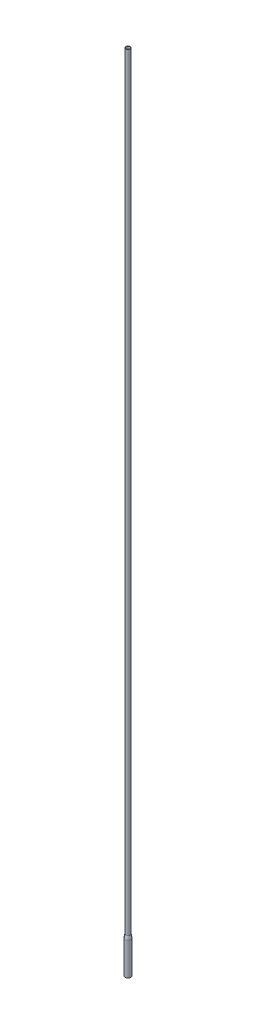
ISO-10303-21;
HEADER;
FILE_DESCRIPTION(('STEP AP214'),'2;1');
FILE_NAME('part.step','',(''),(''),'','','');
FILE_SCHEMA(('AUTOMOTIVE_DESIGN { 1 0 10303 214 1 1 1 1 }'));
ENDSEC;
DATA;
#1=APPLICATION_CONTEXT('core data for automotive mechanical design processes');
#2=APPLICATION_PROTOCOL_DEFINITION('international standard','automotive_design',2000,#1);
#3=PRODUCT_CONTEXT('',#1,'mechanical');
#4=PRODUCT('Part','Part','',(#3));
#5=PRODUCT_RELATED_PRODUCT_CATEGORY('part','',(#4));
#6=PRODUCT_DEFINITION_FORMATION('','',#4);
#7=PRODUCT_DEFINITION_CONTEXT('part definition',#1,'design');
#8=PRODUCT_DEFINITION('design','',#6,#7);
#9=PRODUCT_DEFINITION_SHAPE('','',#8);
#10=(LENGTH_UNIT() NAMED_UNIT(*) SI_UNIT(.MILLI.,.METRE.));
#11=(NAMED_UNIT(*) PLANE_ANGLE_UNIT() SI_UNIT($,.RADIAN.));
#12=(NAMED_UNIT(*) SI_UNIT($,.STERADIAN.) SOLID_ANGLE_UNIT());
#13=UNCERTAINTY_MEASURE_WITH_UNIT(LENGTH_MEASURE(1.E-05),#10,'distance_accuracy_value','');
#14=(GEOMETRIC_REPRESENTATION_CONTEXT(3) GLOBAL_UNCERTAINTY_ASSIGNED_CONTEXT((#13)) GLOBAL_UNIT_ASSIGNED_CONTEXT((#10,
#11,#12)) REPRESENTATION_CONTEXT('',''));
#15=CARTESIAN_POINT('',(0.,0.,0.));
#16=DIRECTION('',(0.,0.,1.));
#17=DIRECTION('',(1.,0.,0.));
#18=AXIS2_PLACEMENT_3D('',#15,#16,#17);
#19=CARTESIAN_POINT('',(34.1668556216027,-100.,-21.3989985174533));
#20=DIRECTION('',(0.,1.,0.));
#21=DIRECTION('',(0.,0.,1.));
#22=AXIS2_PLACEMENT_3D('',#19,#20,#21);
#23=CYLINDRICAL_SURFACE('',#22,8.);
#24=CARTESIAN_POINT('',(34.1668556216027,-100.,-21.3989985174533));
#25=DIRECTION('',(0.,-1.,0.));
#26=DIRECTION('',(0.,0.,-1.));
#27=AXIS2_PLACEMENT_3D('',#24,#25,#26);
#28=CIRCLE('',#27,8.);
#29=CARTESIAN_POINT('',(34.1668556216027,-100.,-29.3989985174533));
#30=VERTEX_POINT('',#29);
#31=EDGE_CURVE('E45',#30,#30,#28,.T.);
#32=ORIENTED_EDGE('',*,*,#31,.F.);
#33=EDGE_LOOP('',(#32));
#34=FACE_BOUND('',#33,.T.);
#35=CARTESIAN_POINT('',(34.1668556216027,-10.,-21.3989985174533));
#36=DIRECTION('',(0.,1.,0.));
#37=DIRECTION('',(0.,0.,1.));
#38=AXIS2_PLACEMENT_3D('',#35,#36,#37);
#39=CIRCLE('',#38,8.00000000000001);
#40=CARTESIAN_POINT('',(34.1668556216027,-10.,-13.3989985174532));
#41=VERTEX_POINT('',#40);
#42=EDGE_CURVE('E53',#41,#41,#39,.T.);
#43=ORIENTED_EDGE('',*,*,#42,.F.);
#44=EDGE_LOOP('',(#43));
#45=FACE_BOUND('',#44,.T.);
#46=ADVANCED_FACE('F38',(#34,#45),#23,.T.);
#47=CARTESIAN_POINT('',(34.1668556216027,-100.,-21.3989985174533));
#48=DIRECTION('',(0.,-1.,0.));
#49=DIRECTION('',(0.,0.,-1.));
#50=AXIS2_PLACEMENT_3D('',#47,#48,#49);
#51=PLANE('',#50);
#52=CARTESIAN_POINT('',(34.1668556216027,-100.,-21.3989985174533));
#53=DIRECTION('',(0.,-1.,0.));
#54=DIRECTION('',(0.,0.,-1.));
#55=AXIS2_PLACEMENT_3D('',#52,#53,#54);
#56=CIRCLE('',#55,7.);
#57=CARTESIAN_POINT('',(34.1668556216027,-100.,-28.3989985174532));
#58=VERTEX_POINT('',#57);
#59=EDGE_CURVE('E58',#58,#58,#56,.T.);
#60=ORIENTED_EDGE('',*,*,#59,.F.);
#61=EDGE_LOOP('',(#60));
#62=FACE_BOUND('',#61,.T.);
#63=ORIENTED_EDGE('',*,*,#31,.T.);
#64=EDGE_LOOP('',(#63));
#65=FACE_BOUND('',#64,.T.);
#66=ADVANCED_FACE('F88',(#62,#65),#51,.T.);
#67=CARTESIAN_POINT('',(34.1668556216027,0.,-21.3989985174533));
#68=DIRECTION('',(0.,-1.,0.));
#69=DIRECTION('',(0.,0.,-1.));
#70=AXIS2_PLACEMENT_3D('',#67,#68,#69);
#71=CONICAL_SURFACE('',#70,6.,0.197395559849881);
#72=ORIENTED_EDGE('',*,*,#42,.T.);
#73=EDGE_LOOP('',(#72));
#74=FACE_BOUND('',#73,.T.);
#75=CARTESIAN_POINT('',(34.1668556216027,0.,-21.3989985174533));
#76=DIRECTION('',(0.,1.,0.));
#77=DIRECTION('',(0.,0.,1.));
#78=AXIS2_PLACEMENT_3D('',#75,#76,#77);
#79=CIRCLE('',#78,6.);
#80=CARTESIAN_POINT('',(34.1668556216027,0.,-15.3989985174532));
#81=VERTEX_POINT('',#80);
#82=EDGE_CURVE('E49',#81,#81,#79,.T.);
#83=ORIENTED_EDGE('',*,*,#82,.F.);
#84=EDGE_LOOP('',(#83));
#85=FACE_BOUND('',#84,.T.);
#86=ADVANCED_FACE('F95',(#74,#85),#71,.T.);
#87=CARTESIAN_POINT('',(34.1668556216027,2110.,-21.3989985174533));
#88=DIRECTION('',(0.,1.,0.));
#89=DIRECTION('',(0.,0.,1.));
#90=AXIS2_PLACEMENT_3D('',#87,#88,#89);
#91=PLANE('',#90);
#92=CARTESIAN_POINT('',(34.1668556216027,2110.,-21.3989985174533));
#93=DIRECTION('',(0.,-1.,0.));
#94=DIRECTION('',(0.,0.,-1.));
#95=AXIS2_PLACEMENT_3D('',#92,#93,#94);
#96=CIRCLE('',#95,5.);
#97=CARTESIAN_POINT('',(34.1668556216027,2110.,-26.3989985174533));
#98=VERTEX_POINT('',#97);
#99=EDGE_CURVE('E67',#98,#98,#96,.T.);
#100=ORIENTED_EDGE('',*,*,#99,.T.);
#101=EDGE_LOOP('',(#100));
#102=FACE_BOUND('',#101,.T.);
#103=CARTESIAN_POINT('',(34.1668556216027,2110.,-21.3989985174533));
#104=DIRECTION('',(0.,1.,0.));
#105=DIRECTION('',(0.,0.,1.));
#106=AXIS2_PLACEMENT_3D('',#103,#104,#105);
#107=CIRCLE('',#106,6.);
#108=CARTESIAN_POINT('',(34.1668556216027,2110.,-15.3989985174532));
#109=VERTEX_POINT('',#108);
#110=EDGE_CURVE('E11',#109,#109,#107,.T.);
#111=ORIENTED_EDGE('',*,*,#110,.T.);
#112=EDGE_LOOP('',(#111));
#113=FACE_BOUND('',#112,.T.);
#114=ADVANCED_FACE('F71',(#102,#113),#91,.T.);
#115=CARTESIAN_POINT('',(34.1668556216027,2110.,-21.3989985174533));
#116=DIRECTION('',(0.,-1.,0.));
#117=DIRECTION('',(0.,0.,-1.));
#118=AXIS2_PLACEMENT_3D('',#115,#116,#117);
#119=CYLINDRICAL_SURFACE('',#118,6.);
#120=ORIENTED_EDGE('',*,*,#110,.F.);
#121=EDGE_LOOP('',(#120));
#122=FACE_BOUND('',#121,.T.);
#123=ORIENTED_EDGE('',*,*,#82,.T.);
#124=EDGE_LOOP('',(#123));
#125=FACE_BOUND('',#124,.T.);
#126=ADVANCED_FACE('F40',(#122,#125),#119,.T.);
#127=CARTESIAN_POINT('',(34.1668556216027,-100.,-21.3989985174533));
#128=DIRECTION('',(0.,1.,0.));
#129=DIRECTION('',(0.,0.,1.));
#130=AXIS2_PLACEMENT_3D('',#127,#128,#129);
#131=CYLINDRICAL_SURFACE('',#130,7.);
#132=ORIENTED_EDGE('',*,*,#59,.T.);
#133=EDGE_LOOP('',(#132));
#134=FACE_BOUND('',#133,.T.);
#135=CARTESIAN_POINT('',(34.1668556216027,-10.0990195135928,-21.3989985174533));
#136=DIRECTION('',(0.,-1.,0.));
#137=DIRECTION('',(0.,0.,-1.));
#138=AXIS2_PLACEMENT_3D('',#135,#136,#137);
#139=CIRCLE('',#138,7.);
#140=CARTESIAN_POINT('',(34.1668556216027,-10.0990195135928,-28.3989985174532));
#141=VERTEX_POINT('',#140);
#142=EDGE_CURVE('E64',#141,#141,#139,.F.);
#143=ORIENTED_EDGE('',*,*,#142,.T.);
#144=EDGE_LOOP('',(#143));
#145=FACE_BOUND('',#144,.T.);
#146=ADVANCED_FACE('F82',(#134,#145),#131,.F.);
#147=CARTESIAN_POINT('',(34.1668556216027,-0.196116135138184,-21.3989985174533));
#148=DIRECTION('',(0.,-1.,0.));
#149=DIRECTION('',(0.,0.,-1.));
#150=AXIS2_PLACEMENT_3D('',#147,#148,#149);
#151=CONICAL_SURFACE('',#150,5.01941932430908,0.197395559849881);
#152=ORIENTED_EDGE('',*,*,#142,.F.);
#153=EDGE_LOOP('',(#152));
#154=FACE_BOUND('',#153,.T.);
#155=CARTESIAN_POINT('',(34.1668556216027,-0.0990195135927793,-21.3989985174533));
#156=DIRECTION('',(0.,-1.,0.));
#157=DIRECTION('',(0.,0.,-1.));
#158=AXIS2_PLACEMENT_3D('',#155,#156,#157);
#159=CIRCLE('',#158,5.);
#160=CARTESIAN_POINT('',(34.1668556216027,-0.0990195135927793,-26.3989985174533));
#161=VERTEX_POINT('',#160);
#162=EDGE_CURVE('E61',#161,#161,#159,.F.);
#163=ORIENTED_EDGE('',*,*,#162,.T.);
#164=EDGE_LOOP('',(#163));
#165=FACE_BOUND('',#164,.T.);
#166=ADVANCED_FACE('F75',(#154,#165),#151,.F.);
#167=CARTESIAN_POINT('',(34.1668556216027,2110.,-21.3989985174533));
#168=DIRECTION('',(0.,-1.,0.));
#169=DIRECTION('',(0.,0.,-1.));
#170=AXIS2_PLACEMENT_3D('',#167,#168,#169);
#171=CYLINDRICAL_SURFACE('',#170,5.);
#172=ORIENTED_EDGE('',*,*,#162,.F.);
#173=EDGE_LOOP('',(#172));
#174=FACE_BOUND('',#173,.T.);
#175=ORIENTED_EDGE('',*,*,#99,.F.);
#176=EDGE_LOOP('',(#175));
#177=FACE_BOUND('',#176,.T.);
#178=ADVANCED_FACE('F73',(#174,#177),#171,.F.);
#179=CLOSED_SHELL('',(#46,#66,#86,#114,#126,#146,#166,#178));
#180=MANIFOLD_SOLID_BREP('B2',#179);
#181=ADVANCED_BREP_SHAPE_REPRESENTATION('',(#18,#180),#14);
#182=SHAPE_DEFINITION_REPRESENTATION(#9,#181);
ENDSEC;
END-ISO-10303-21;
